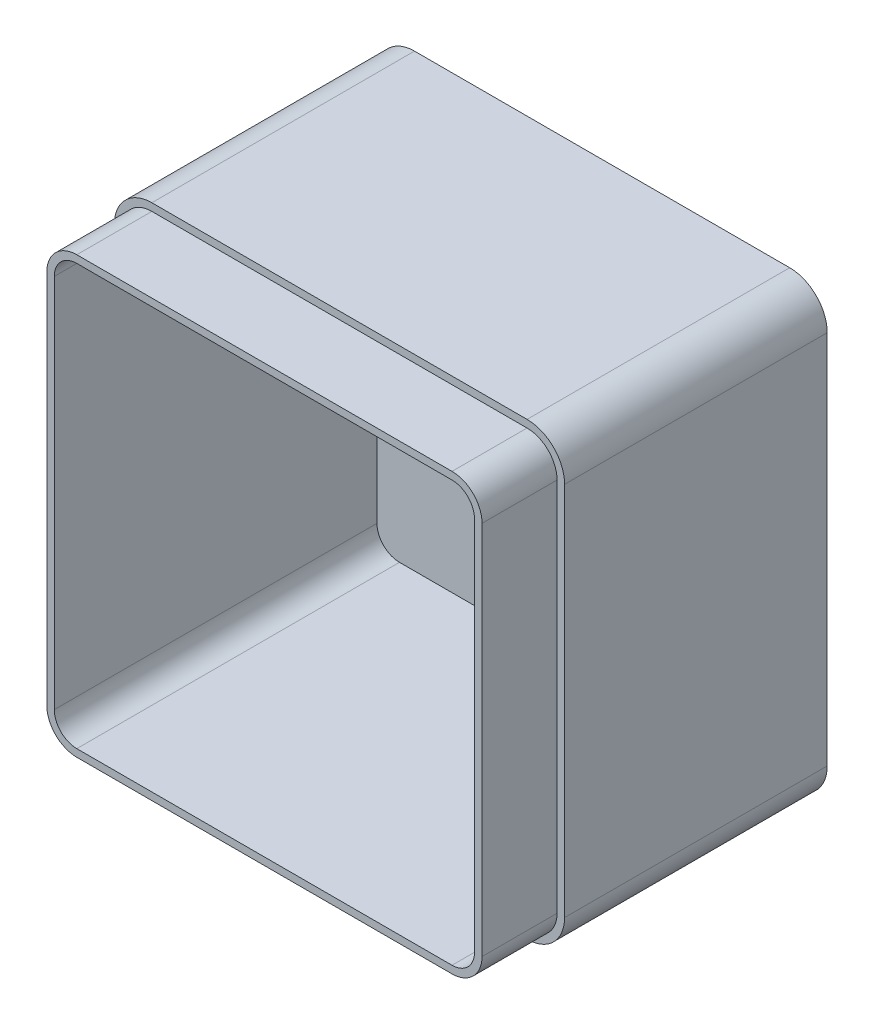
ISO-10303-21;
HEADER;
FILE_DESCRIPTION(('STEP AP214'),'2;1');
FILE_NAME('part.step','',(''),(''),'','','');
FILE_SCHEMA(('AUTOMOTIVE_DESIGN { 1 0 10303 214 1 1 1 1 }'));
ENDSEC;
DATA;
#1=APPLICATION_CONTEXT('core data for automotive mechanical design processes');
#2=APPLICATION_PROTOCOL_DEFINITION('international standard','automotive_design',2000,#1);
#3=PRODUCT_CONTEXT('',#1,'mechanical');
#4=PRODUCT('Part','Part','',(#3));
#5=PRODUCT_RELATED_PRODUCT_CATEGORY('part','',(#4));
#6=PRODUCT_DEFINITION_FORMATION('','',#4);
#7=PRODUCT_DEFINITION_CONTEXT('part definition',#1,'design');
#8=PRODUCT_DEFINITION('design','',#6,#7);
#9=PRODUCT_DEFINITION_SHAPE('','',#8);
#10=(LENGTH_UNIT() NAMED_UNIT(*) SI_UNIT(.MILLI.,.METRE.));
#11=(NAMED_UNIT(*) PLANE_ANGLE_UNIT() SI_UNIT($,.RADIAN.));
#12=(NAMED_UNIT(*) SI_UNIT($,.STERADIAN.) SOLID_ANGLE_UNIT());
#13=UNCERTAINTY_MEASURE_WITH_UNIT(LENGTH_MEASURE(1.E-05),#10,'distance_accuracy_value','');
#14=(GEOMETRIC_REPRESENTATION_CONTEXT(3) GLOBAL_UNCERTAINTY_ASSIGNED_CONTEXT((#13)) GLOBAL_UNIT_ASSIGNED_CONTEXT((#10,
#11,#12)) REPRESENTATION_CONTEXT('',''));
#15=CARTESIAN_POINT('',(0.,0.,0.));
#16=DIRECTION('',(0.,0.,1.));
#17=DIRECTION('',(1.,0.,0.));
#18=AXIS2_PLACEMENT_3D('',#15,#16,#17);
#19=CARTESIAN_POINT('',(0.,0.,90.));
#20=DIRECTION('',(0.,0.,-1.));
#21=DIRECTION('',(-1.,0.,0.));
#22=AXIS2_PLACEMENT_3D('',#19,#20,#21);
#23=PLANE('',#22);
#24=DIRECTION('',(0.,-1.,0.));
#25=VECTOR('',#24,1.);
#26=CARTESIAN_POINT('',(4.,0.,90.));
#27=LINE('',#26,#25);
#28=CARTESIAN_POINT('',(3.99999999999996,110.,90.));
#29=VERTEX_POINT('',#28);
#30=CARTESIAN_POINT('',(4.,10.,90.));
#31=VERTEX_POINT('',#30);
#32=EDGE_CURVE('E361',#29,#31,#27,.T.);
#33=ORIENTED_EDGE('',*,*,#32,.F.);
#34=CARTESIAN_POINT('',(9.99999999999996,110.,90.));
#35=DIRECTION('',(0.,0.,-1.));
#36=DIRECTION('',(-1.,0.,0.));
#37=AXIS2_PLACEMENT_3D('',#34,#35,#36);
#38=CIRCLE('',#37,6.);
#39=CARTESIAN_POINT('',(9.99999999999996,116.,90.));
#40=VERTEX_POINT('',#39);
#41=EDGE_CURVE('E407',#40,#29,#38,.F.);
#42=ORIENTED_EDGE('',*,*,#41,.F.);
#43=DIRECTION('',(-1.,0.,0.));
#44=VECTOR('',#43,1.);
#45=CARTESIAN_POINT('',(0.,116.,90.));
#46=LINE('',#45,#44);
#47=CARTESIAN_POINT('',(110.,116.,90.));
#48=VERTEX_POINT('',#47);
#49=EDGE_CURVE('E376',#48,#40,#46,.T.);
#50=ORIENTED_EDGE('',*,*,#49,.F.);
#51=CARTESIAN_POINT('',(110.,110.,90.));
#52=DIRECTION('',(0.,0.,-1.));
#53=DIRECTION('',(-1.,0.,0.));
#54=AXIS2_PLACEMENT_3D('',#51,#52,#53);
#55=CIRCLE('',#54,6.);
#56=CARTESIAN_POINT('',(116.,110.,90.));
#57=VERTEX_POINT('',#56);
#58=EDGE_CURVE('E340',#57,#48,#55,.F.);
#59=ORIENTED_EDGE('',*,*,#58,.F.);
#60=DIRECTION('',(0.,1.,0.));
#61=VECTOR('',#60,1.);
#62=CARTESIAN_POINT('',(116.,0.,90.));
#63=LINE('',#62,#61);
#64=CARTESIAN_POINT('',(116.,10.,90.));
#65=VERTEX_POINT('',#64);
#66=EDGE_CURVE('E404',#65,#57,#63,.T.);
#67=ORIENTED_EDGE('',*,*,#66,.F.);
#68=CARTESIAN_POINT('',(110.,10.,90.));
#69=DIRECTION('',(0.,0.,-1.));
#70=DIRECTION('',(-1.,0.,0.));
#71=AXIS2_PLACEMENT_3D('',#68,#69,#70);
#72=CIRCLE('',#71,6.);
#73=CARTESIAN_POINT('',(110.,4.,90.));
#74=VERTEX_POINT('',#73);
#75=EDGE_CURVE('E400',#74,#65,#72,.F.);
#76=ORIENTED_EDGE('',*,*,#75,.F.);
#77=DIRECTION('',(1.,0.,0.));
#78=VECTOR('',#77,1.);
#79=CARTESIAN_POINT('',(0.,4.,90.));
#80=LINE('',#79,#78);
#81=CARTESIAN_POINT('',(9.99999999999999,4.,90.));
#82=VERTEX_POINT('',#81);
#83=EDGE_CURVE('E397',#82,#74,#80,.T.);
#84=ORIENTED_EDGE('',*,*,#83,.F.);
#85=CARTESIAN_POINT('',(9.99999999999999,10.,90.));
#86=DIRECTION('',(0.,0.,-1.));
#87=DIRECTION('',(-1.,0.,0.));
#88=AXIS2_PLACEMENT_3D('',#85,#86,#87);
#89=CIRCLE('',#88,6.);
#90=EDGE_CURVE('E385',#31,#82,#89,.F.);
#91=ORIENTED_EDGE('',*,*,#90,.F.);
#92=EDGE_LOOP('',(#33,#42,#50,#59,#67,#76,#84,#91));
#93=FACE_BOUND('',#92,.T.);
#94=CARTESIAN_POINT('',(9.99999999999996,110.,90.));
#95=DIRECTION('',(0.,0.,1.));
#96=DIRECTION('',(1.,0.,0.));
#97=AXIS2_PLACEMENT_3D('',#94,#95,#96);
#98=CIRCLE('',#97,8.);
#99=CARTESIAN_POINT('',(9.99999999999995,118.,90.));
#100=VERTEX_POINT('',#99);
#101=CARTESIAN_POINT('',(1.99999999999996,110.,90.));
#102=VERTEX_POINT('',#101);
#103=EDGE_CURVE('E268',#100,#102,#98,.T.);
#104=ORIENTED_EDGE('',*,*,#103,.T.);
#105=DIRECTION('',(0.,-1.,0.));
#106=VECTOR('',#105,1.);
#107=CARTESIAN_POINT('',(1.99999999999996,110.,90.));
#108=LINE('',#107,#106);
#109=CARTESIAN_POINT('',(1.99999999999996,9.99999999999999,90.));
#110=VERTEX_POINT('',#109);
#111=EDGE_CURVE('E218',#102,#110,#108,.T.);
#112=ORIENTED_EDGE('',*,*,#111,.T.);
#113=CARTESIAN_POINT('',(9.99999999999999,10.,90.));
#114=DIRECTION('',(0.,0.,1.));
#115=DIRECTION('',(1.,0.,0.));
#116=AXIS2_PLACEMENT_3D('',#113,#114,#115);
#117=CIRCLE('',#116,8.00000000000001);
#118=CARTESIAN_POINT('',(9.99999999999999,1.99999999999998,90.));
#119=VERTEX_POINT('',#118);
#120=EDGE_CURVE('E66',#110,#119,#117,.T.);
#121=ORIENTED_EDGE('',*,*,#120,.T.);
#122=DIRECTION('',(1.,0.,0.));
#123=VECTOR('',#122,1.);
#124=CARTESIAN_POINT('',(9.99999999999999,2.,90.));
#125=LINE('',#124,#123);
#126=CARTESIAN_POINT('',(110.,2.,90.));
#127=VERTEX_POINT('',#126);
#128=EDGE_CURVE('E275',#119,#127,#125,.T.);
#129=ORIENTED_EDGE('',*,*,#128,.T.);
#130=CARTESIAN_POINT('',(110.,10.,90.));
#131=DIRECTION('',(0.,0.,1.));
#132=DIRECTION('',(1.,0.,0.));
#133=AXIS2_PLACEMENT_3D('',#130,#131,#132);
#134=CIRCLE('',#133,7.99999999999999);
#135=CARTESIAN_POINT('',(118.,10.,90.));
#136=VERTEX_POINT('',#135);
#137=EDGE_CURVE('E279',#127,#136,#134,.T.);
#138=ORIENTED_EDGE('',*,*,#137,.T.);
#139=DIRECTION('',(0.,1.,0.));
#140=VECTOR('',#139,1.);
#141=CARTESIAN_POINT('',(118.,9.99999999999999,90.));
#142=LINE('',#141,#140);
#143=CARTESIAN_POINT('',(118.,110.,90.));
#144=VERTEX_POINT('',#143);
#145=EDGE_CURVE('E283',#136,#144,#142,.T.);
#146=ORIENTED_EDGE('',*,*,#145,.T.);
#147=CARTESIAN_POINT('',(110.,110.,90.));
#148=DIRECTION('',(0.,0.,1.));
#149=DIRECTION('',(1.,0.,0.));
#150=AXIS2_PLACEMENT_3D('',#147,#148,#149);
#151=CIRCLE('',#150,8.00000000000001);
#152=CARTESIAN_POINT('',(110.,118.,90.));
#153=VERTEX_POINT('',#152);
#154=EDGE_CURVE('E245',#144,#153,#151,.T.);
#155=ORIENTED_EDGE('',*,*,#154,.T.);
#156=DIRECTION('',(-1.,0.,0.));
#157=VECTOR('',#156,1.);
#158=CARTESIAN_POINT('',(110.,118.,90.));
#159=LINE('',#158,#157);
#160=EDGE_CURVE('E241',#153,#100,#159,.T.);
#161=ORIENTED_EDGE('',*,*,#160,.T.);
#162=EDGE_LOOP('',(#104,#112,#121,#129,#138,#146,#155,#161));
#163=FACE_BOUND('',#162,.T.);
#164=ADVANCED_FACE('F50',(#93,#163),#23,.F.);
#165=CARTESIAN_POINT('',(4.,0.,90.));
#166=DIRECTION('',(1.,0.,0.));
#167=DIRECTION('',(0.,1.,0.));
#168=AXIS2_PLACEMENT_3D('',#165,#166,#167);
#169=PLANE('',#168);
#170=DIRECTION('',(0.,-1.,0.));
#171=VECTOR('',#170,1.);
#172=CARTESIAN_POINT('',(4.,0.,4.));
#173=LINE('',#172,#171);
#174=CARTESIAN_POINT('',(3.99999999999996,110.,4.));
#175=VERTEX_POINT('',#174);
#176=CARTESIAN_POINT('',(4.,10.,4.));
#177=VERTEX_POINT('',#176);
#178=EDGE_CURVE('E332',#175,#177,#173,.T.);
#179=ORIENTED_EDGE('',*,*,#178,.F.);
#180=DIRECTION('',(0.,0.,1.));
#181=VECTOR('',#180,1.);
#182=CARTESIAN_POINT('',(3.99999999999996,110.,90.));
#183=LINE('',#182,#181);
#184=EDGE_CURVE('E341',#29,#175,#183,.F.);
#185=ORIENTED_EDGE('',*,*,#184,.F.);
#186=ORIENTED_EDGE('',*,*,#32,.T.);
#187=DIRECTION('',(0.,0.,1.));
#188=VECTOR('',#187,1.);
#189=CARTESIAN_POINT('',(4.,10.,90.));
#190=LINE('',#189,#188);
#191=EDGE_CURVE('E337',#177,#31,#190,.T.);
#192=ORIENTED_EDGE('',*,*,#191,.F.);
#193=EDGE_LOOP('',(#179,#185,#186,#192));
#194=FACE_BOUND('',#193,.T.);
#195=ADVANCED_FACE('F515',(#194),#169,.T.);
#196=CARTESIAN_POINT('',(0.,4.,90.));
#197=DIRECTION('',(0.,1.,0.));
#198=DIRECTION('',(0.,0.,1.));
#199=AXIS2_PLACEMENT_3D('',#196,#197,#198);
#200=PLANE('',#199);
#201=ORIENTED_EDGE('',*,*,#83,.T.);
#202=DIRECTION('',(0.,0.,1.));
#203=VECTOR('',#202,1.);
#204=CARTESIAN_POINT('',(110.,4.,90.));
#205=LINE('',#204,#203);
#206=CARTESIAN_POINT('',(110.,4.,4.));
#207=VERTEX_POINT('',#206);
#208=EDGE_CURVE('E373',#207,#74,#205,.T.);
#209=ORIENTED_EDGE('',*,*,#208,.F.);
#210=DIRECTION('',(1.,0.,0.));
#211=VECTOR('',#210,1.);
#212=CARTESIAN_POINT('',(0.,4.,4.));
#213=LINE('',#212,#211);
#214=CARTESIAN_POINT('',(9.99999999999999,4.,4.));
#215=VERTEX_POINT('',#214);
#216=EDGE_CURVE('E336',#215,#207,#213,.T.);
#217=ORIENTED_EDGE('',*,*,#216,.F.);
#218=DIRECTION('',(0.,0.,1.));
#219=VECTOR('',#218,1.);
#220=CARTESIAN_POINT('',(9.99999999999999,4.,90.));
#221=LINE('',#220,#219);
#222=EDGE_CURVE('E364',#82,#215,#221,.F.);
#223=ORIENTED_EDGE('',*,*,#222,.F.);
#224=EDGE_LOOP('',(#201,#209,#217,#223));
#225=FACE_BOUND('',#224,.T.);
#226=ADVANCED_FACE('F521',(#225),#200,.T.);
#227=CARTESIAN_POINT('',(116.,0.,90.));
#228=DIRECTION('',(-1.,0.,0.));
#229=DIRECTION('',(0.,-1.,0.));
#230=AXIS2_PLACEMENT_3D('',#227,#228,#229);
#231=PLANE('',#230);
#232=ORIENTED_EDGE('',*,*,#66,.T.);
#233=DIRECTION('',(0.,0.,1.));
#234=VECTOR('',#233,1.);
#235=CARTESIAN_POINT('',(116.,110.,90.));
#236=LINE('',#235,#234);
#237=CARTESIAN_POINT('',(116.,110.,4.));
#238=VERTEX_POINT('',#237);
#239=EDGE_CURVE('E382',#238,#57,#236,.T.);
#240=ORIENTED_EDGE('',*,*,#239,.F.);
#241=DIRECTION('',(0.,1.,0.));
#242=VECTOR('',#241,1.);
#243=CARTESIAN_POINT('',(116.,0.,4.));
#244=LINE('',#243,#242);
#245=CARTESIAN_POINT('',(116.,10.,4.));
#246=VERTEX_POINT('',#245);
#247=EDGE_CURVE('E349',#246,#238,#244,.T.);
#248=ORIENTED_EDGE('',*,*,#247,.F.);
#249=DIRECTION('',(0.,0.,1.));
#250=VECTOR('',#249,1.);
#251=CARTESIAN_POINT('',(116.,10.,90.));
#252=LINE('',#251,#250);
#253=EDGE_CURVE('E377',#65,#246,#252,.F.);
#254=ORIENTED_EDGE('',*,*,#253,.F.);
#255=EDGE_LOOP('',(#232,#240,#248,#254));
#256=FACE_BOUND('',#255,.T.);
#257=ADVANCED_FACE('F737',(#256),#231,.T.);
#258=CARTESIAN_POINT('',(0.,116.,90.));
#259=DIRECTION('',(0.,-1.,0.));
#260=DIRECTION('',(0.,0.,-1.));
#261=AXIS2_PLACEMENT_3D('',#258,#259,#260);
#262=PLANE('',#261);
#263=DIRECTION('',(-1.,0.,0.));
#264=VECTOR('',#263,1.);
#265=CARTESIAN_POINT('',(0.,116.,4.));
#266=LINE('',#265,#264);
#267=CARTESIAN_POINT('',(110.,116.,4.));
#268=VERTEX_POINT('',#267);
#269=CARTESIAN_POINT('',(9.99999999999996,116.,4.));
#270=VERTEX_POINT('',#269);
#271=EDGE_CURVE('E357',#268,#270,#266,.T.);
#272=ORIENTED_EDGE('',*,*,#271,.F.);
#273=DIRECTION('',(0.,0.,-1.));
#274=VECTOR('',#273,1.);
#275=CARTESIAN_POINT('',(110.,116.,90.));
#276=LINE('',#275,#274);
#277=EDGE_CURVE('E381',#48,#268,#276,.T.);
#278=ORIENTED_EDGE('',*,*,#277,.F.);
#279=ORIENTED_EDGE('',*,*,#49,.T.);
#280=DIRECTION('',(0.,0.,-1.));
#281=VECTOR('',#280,1.);
#282=CARTESIAN_POINT('',(9.99999999999996,116.,90.));
#283=LINE('',#282,#281);
#284=EDGE_CURVE('E389',#270,#40,#283,.F.);
#285=ORIENTED_EDGE('',*,*,#284,.F.);
#286=EDGE_LOOP('',(#272,#278,#279,#285));
#287=FACE_BOUND('',#286,.T.);
#288=ADVANCED_FACE('F729',(#287),#262,.T.);
#289=CARTESIAN_POINT('',(0.,0.,4.));
#290=DIRECTION('',(0.,0.,-1.));
#291=DIRECTION('',(-1.,0.,0.));
#292=AXIS2_PLACEMENT_3D('',#289,#290,#291);
#293=PLANE('',#292);
#294=ORIENTED_EDGE('',*,*,#216,.T.);
#295=CARTESIAN_POINT('',(110.,10.,4.));
#296=DIRECTION('',(0.,0.,-1.));
#297=DIRECTION('',(-1.,0.,0.));
#298=AXIS2_PLACEMENT_3D('',#295,#296,#297);
#299=CIRCLE('',#298,6.);
#300=EDGE_CURVE('E352',#246,#207,#299,.T.);
#301=ORIENTED_EDGE('',*,*,#300,.F.);
#302=ORIENTED_EDGE('',*,*,#247,.T.);
#303=CARTESIAN_POINT('',(110.,110.,4.));
#304=DIRECTION('',(0.,0.,-1.));
#305=DIRECTION('',(-1.,0.,0.));
#306=AXIS2_PLACEMENT_3D('',#303,#304,#305);
#307=CIRCLE('',#306,6.);
#308=EDGE_CURVE('E356',#268,#238,#307,.T.);
#309=ORIENTED_EDGE('',*,*,#308,.F.);
#310=ORIENTED_EDGE('',*,*,#271,.T.);
#311=CARTESIAN_POINT('',(9.99999999999996,110.,4.));
#312=DIRECTION('',(0.,0.,-1.));
#313=DIRECTION('',(-1.,0.,0.));
#314=AXIS2_PLACEMENT_3D('',#311,#312,#313);
#315=CIRCLE('',#314,6.);
#316=EDGE_CURVE('E353',#175,#270,#315,.T.);
#317=ORIENTED_EDGE('',*,*,#316,.F.);
#318=ORIENTED_EDGE('',*,*,#178,.T.);
#319=CARTESIAN_POINT('',(9.99999999999999,10.,4.));
#320=DIRECTION('',(0.,0.,-1.));
#321=DIRECTION('',(-1.,0.,0.));
#322=AXIS2_PLACEMENT_3D('',#319,#320,#321);
#323=CIRCLE('',#322,6.);
#324=EDGE_CURVE('E345',#215,#177,#323,.T.);
#325=ORIENTED_EDGE('',*,*,#324,.F.);
#326=EDGE_LOOP('',(#294,#301,#302,#309,#310,#317,#318,#325));
#327=FACE_BOUND('',#326,.T.);
#328=ADVANCED_FACE('F721',(#327),#293,.F.);
#329=CARTESIAN_POINT('',(9.99999999999999,10.,90.));
#330=DIRECTION('',(0.,0.,-1.));
#331=DIRECTION('',(-1.,0.,0.));
#332=AXIS2_PLACEMENT_3D('',#329,#330,#331);
#333=CYLINDRICAL_SURFACE('',#332,6.);
#334=ORIENTED_EDGE('',*,*,#90,.T.);
#335=ORIENTED_EDGE('',*,*,#222,.T.);
#336=ORIENTED_EDGE('',*,*,#324,.T.);
#337=ORIENTED_EDGE('',*,*,#191,.T.);
#338=EDGE_LOOP('',(#334,#335,#336,#337));
#339=FACE_BOUND('',#338,.T.);
#340=ADVANCED_FACE('F713',(#339),#333,.F.);
#341=CARTESIAN_POINT('',(110.,10.,90.));
#342=DIRECTION('',(0.,0.,-1.));
#343=DIRECTION('',(-1.,0.,0.));
#344=AXIS2_PLACEMENT_3D('',#341,#342,#343);
#345=CYLINDRICAL_SURFACE('',#344,6.);
#346=ORIENTED_EDGE('',*,*,#75,.T.);
#347=ORIENTED_EDGE('',*,*,#253,.T.);
#348=ORIENTED_EDGE('',*,*,#300,.T.);
#349=ORIENTED_EDGE('',*,*,#208,.T.);
#350=EDGE_LOOP('',(#346,#347,#348,#349));
#351=FACE_BOUND('',#350,.T.);
#352=ADVANCED_FACE('F706',(#351),#345,.F.);
#353=CARTESIAN_POINT('',(9.99999999999996,110.,90.));
#354=DIRECTION('',(0.,0.,-1.));
#355=DIRECTION('',(-1.,0.,0.));
#356=AXIS2_PLACEMENT_3D('',#353,#354,#355);
#357=CYLINDRICAL_SURFACE('',#356,6.);
#358=ORIENTED_EDGE('',*,*,#41,.T.);
#359=ORIENTED_EDGE('',*,*,#184,.T.);
#360=ORIENTED_EDGE('',*,*,#316,.T.);
#361=ORIENTED_EDGE('',*,*,#284,.T.);
#362=EDGE_LOOP('',(#358,#359,#360,#361));
#363=FACE_BOUND('',#362,.T.);
#364=ADVANCED_FACE('F702',(#363),#357,.F.);
#365=CARTESIAN_POINT('',(110.,110.,90.));
#366=DIRECTION('',(0.,0.,-1.));
#367=DIRECTION('',(-1.,0.,0.));
#368=AXIS2_PLACEMENT_3D('',#365,#366,#367);
#369=CYLINDRICAL_SURFACE('',#368,6.);
#370=ORIENTED_EDGE('',*,*,#58,.T.);
#371=ORIENTED_EDGE('',*,*,#277,.T.);
#372=ORIENTED_EDGE('',*,*,#308,.T.);
#373=ORIENTED_EDGE('',*,*,#239,.T.);
#374=EDGE_LOOP('',(#370,#371,#372,#373));
#375=FACE_BOUND('',#374,.T.);
#376=ADVANCED_FACE('F528',(#375),#369,.F.);
#377=CARTESIAN_POINT('',(9.99999999999996,110.,70.));
#378=DIRECTION('',(0.,0.,1.));
#379=DIRECTION('',(1.,0.,0.));
#380=AXIS2_PLACEMENT_3D('',#377,#378,#379);
#381=PLANE('',#380);
#382=DIRECTION('',(-1.,0.,0.));
#383=VECTOR('',#382,1.);
#384=CARTESIAN_POINT('',(110.,118.,70.));
#385=LINE('',#384,#383);
#386=CARTESIAN_POINT('',(110.,118.,70.));
#387=VERTEX_POINT('',#386);
#388=CARTESIAN_POINT('',(9.99999999999995,118.,70.));
#389=VERTEX_POINT('',#388);
#390=EDGE_CURVE('E225',#387,#389,#385,.T.);
#391=ORIENTED_EDGE('',*,*,#390,.F.);
#392=CARTESIAN_POINT('',(110.,110.,70.));
#393=DIRECTION('',(0.,0.,1.));
#394=DIRECTION('',(1.,0.,0.));
#395=AXIS2_PLACEMENT_3D('',#392,#393,#394);
#396=CIRCLE('',#395,8.00000000000001);
#397=CARTESIAN_POINT('',(118.,110.,70.));
#398=VERTEX_POINT('',#397);
#399=EDGE_CURVE('E262',#398,#387,#396,.T.);
#400=ORIENTED_EDGE('',*,*,#399,.F.);
#401=DIRECTION('',(0.,1.,0.));
#402=VECTOR('',#401,1.);
#403=CARTESIAN_POINT('',(118.,9.99999999999999,70.));
#404=LINE('',#403,#402);
#405=CARTESIAN_POINT('',(118.,10.,70.));
#406=VERTEX_POINT('',#405);
#407=EDGE_CURVE('E258',#406,#398,#404,.T.);
#408=ORIENTED_EDGE('',*,*,#407,.F.);
#409=CARTESIAN_POINT('',(110.,10.,70.));
#410=DIRECTION('',(0.,0.,1.));
#411=DIRECTION('',(1.,0.,0.));
#412=AXIS2_PLACEMENT_3D('',#409,#410,#411);
#413=CIRCLE('',#412,7.99999999999999);
#414=CARTESIAN_POINT('',(110.,2.,70.));
#415=VERTEX_POINT('',#414);
#416=EDGE_CURVE('E254',#415,#406,#413,.T.);
#417=ORIENTED_EDGE('',*,*,#416,.F.);
#418=DIRECTION('',(1.,0.,0.));
#419=VECTOR('',#418,1.);
#420=CARTESIAN_POINT('',(9.99999999999999,2.,70.));
#421=LINE('',#420,#419);
#422=CARTESIAN_POINT('',(9.99999999999999,1.99999999999998,70.));
#423=VERTEX_POINT('',#422);
#424=EDGE_CURVE('E250',#423,#415,#421,.T.);
#425=ORIENTED_EDGE('',*,*,#424,.F.);
#426=CARTESIAN_POINT('',(9.99999999999999,10.,70.));
#427=DIRECTION('',(0.,0.,1.));
#428=DIRECTION('',(1.,0.,0.));
#429=AXIS2_PLACEMENT_3D('',#426,#427,#428);
#430=CIRCLE('',#429,8.00000000000001);
#431=CARTESIAN_POINT('',(1.99999999999996,9.99999999999999,70.));
#432=VERTEX_POINT('',#431);
#433=EDGE_CURVE('E235',#432,#423,#430,.T.);
#434=ORIENTED_EDGE('',*,*,#433,.F.);
#435=DIRECTION('',(0.,-1.,0.));
#436=VECTOR('',#435,1.);
#437=CARTESIAN_POINT('',(1.99999999999996,110.,70.));
#438=LINE('',#437,#436);
#439=CARTESIAN_POINT('',(1.99999999999996,110.,70.));
#440=VERTEX_POINT('',#439);
#441=EDGE_CURVE('E216',#440,#432,#438,.T.);
#442=ORIENTED_EDGE('',*,*,#441,.F.);
#443=CARTESIAN_POINT('',(9.99999999999996,110.,70.));
#444=DIRECTION('',(0.,0.,1.));
#445=DIRECTION('',(1.,0.,0.));
#446=AXIS2_PLACEMENT_3D('',#443,#444,#445);
#447=CIRCLE('',#446,8.);
#448=EDGE_CURVE('E231',#389,#440,#447,.T.);
#449=ORIENTED_EDGE('',*,*,#448,.F.);
#450=EDGE_LOOP('',(#391,#400,#408,#417,#425,#434,#442,#449));
#451=FACE_BOUND('',#450,.T.);
#452=CARTESIAN_POINT('',(9.99999999999996,110.,70.));
#453=DIRECTION('',(0.,0.,1.));
#454=DIRECTION('',(1.,0.,0.));
#455=AXIS2_PLACEMENT_3D('',#452,#453,#454);
#456=CIRCLE('',#455,10.);
#457=CARTESIAN_POINT('',(9.99999999999996,120.,70.));
#458=VERTEX_POINT('',#457);
#459=CARTESIAN_POINT('',(0.,110.,70.));
#460=VERTEX_POINT('',#459);
#461=EDGE_CURVE('E292',#458,#460,#456,.T.);
#462=ORIENTED_EDGE('',*,*,#461,.T.);
#463=DIRECTION('',(0.,-1.,0.));
#464=VECTOR('',#463,1.);
#465=CARTESIAN_POINT('',(0.,110.,70.));
#466=LINE('',#465,#464);
#467=CARTESIAN_POINT('',(0.,9.99999999999999,70.));
#468=VERTEX_POINT('',#467);
#469=EDGE_CURVE('E312',#460,#468,#466,.T.);
#470=ORIENTED_EDGE('',*,*,#469,.T.);
#471=CARTESIAN_POINT('',(9.99999999999999,10.,70.));
#472=DIRECTION('',(0.,0.,1.));
#473=DIRECTION('',(1.,0.,0.));
#474=AXIS2_PLACEMENT_3D('',#471,#472,#473);
#475=CIRCLE('',#474,10.);
#476=CARTESIAN_POINT('',(9.99999999999999,0.,70.));
#477=VERTEX_POINT('',#476);
#478=EDGE_CURVE('E315',#468,#477,#475,.T.);
#479=ORIENTED_EDGE('',*,*,#478,.T.);
#480=DIRECTION('',(1.,0.,0.));
#481=VECTOR('',#480,1.);
#482=CARTESIAN_POINT('',(9.99999999999999,0.,70.));
#483=LINE('',#482,#481);
#484=CARTESIAN_POINT('',(110.,0.,70.));
#485=VERTEX_POINT('',#484);
#486=EDGE_CURVE('E318',#477,#485,#483,.T.);
#487=ORIENTED_EDGE('',*,*,#486,.T.);
#488=CARTESIAN_POINT('',(110.,10.,70.));
#489=DIRECTION('',(0.,0.,1.));
#490=DIRECTION('',(1.,0.,0.));
#491=AXIS2_PLACEMENT_3D('',#488,#489,#490);
#492=CIRCLE('',#491,9.99999999999999);
#493=CARTESIAN_POINT('',(120.,10.,70.));
#494=VERTEX_POINT('',#493);
#495=EDGE_CURVE('E321',#485,#494,#492,.T.);
#496=ORIENTED_EDGE('',*,*,#495,.T.);
#497=DIRECTION('',(0.,1.,0.));
#498=VECTOR('',#497,1.);
#499=CARTESIAN_POINT('',(120.,10.,70.));
#500=LINE('',#499,#498);
#501=CARTESIAN_POINT('',(120.,110.,70.));
#502=VERTEX_POINT('',#501);
#503=EDGE_CURVE('E74',#494,#502,#500,.T.);
#504=ORIENTED_EDGE('',*,*,#503,.T.);
#505=CARTESIAN_POINT('',(110.,110.,70.));
#506=DIRECTION('',(0.,0.,1.));
#507=DIRECTION('',(1.,0.,0.));
#508=AXIS2_PLACEMENT_3D('',#505,#506,#507);
#509=CIRCLE('',#508,9.99999999999999);
#510=CARTESIAN_POINT('',(110.,120.,70.));
#511=VERTEX_POINT('',#510);
#512=EDGE_CURVE('E326',#502,#511,#509,.T.);
#513=ORIENTED_EDGE('',*,*,#512,.T.);
#514=DIRECTION('',(-1.,0.,0.));
#515=VECTOR('',#514,1.);
#516=CARTESIAN_POINT('',(110.,120.,70.));
#517=LINE('',#516,#515);
#518=EDGE_CURVE('E329',#511,#458,#517,.T.);
#519=ORIENTED_EDGE('',*,*,#518,.T.);
#520=EDGE_LOOP('',(#462,#470,#479,#487,#496,#504,#513,#519));
#521=FACE_BOUND('',#520,.T.);
#522=ADVANCED_FACE('F230',(#451,#521),#381,.T.);
#523=CARTESIAN_POINT('',(9.99999999999996,110.,70.));
#524=DIRECTION('',(0.,0.,1.));
#525=DIRECTION('',(1.,0.,0.));
#526=AXIS2_PLACEMENT_3D('',#523,#524,#525);
#527=CYLINDRICAL_SURFACE('',#526,8.);
#528=ORIENTED_EDGE('',*,*,#103,.F.);
#529=DIRECTION('',(0.,0.,1.));
#530=VECTOR('',#529,1.);
#531=CARTESIAN_POINT('',(9.99999999999995,118.,70.));
#532=LINE('',#531,#530);
#533=EDGE_CURVE('E239',#389,#100,#532,.T.);
#534=ORIENTED_EDGE('',*,*,#533,.F.);
#535=ORIENTED_EDGE('',*,*,#448,.T.);
#536=DIRECTION('',(0.,0.,1.));
#537=VECTOR('',#536,1.);
#538=CARTESIAN_POINT('',(1.99999999999996,110.,70.));
#539=LINE('',#538,#537);
#540=EDGE_CURVE('E213',#440,#102,#539,.T.);
#541=ORIENTED_EDGE('',*,*,#540,.T.);
#542=EDGE_LOOP('',(#528,#534,#535,#541));
#543=FACE_BOUND('',#542,.T.);
#544=ADVANCED_FACE('F238',(#543),#527,.T.);
#545=CARTESIAN_POINT('',(110.,118.,70.));
#546=DIRECTION('',(0.,1.,0.));
#547=DIRECTION('',(0.,0.,1.));
#548=AXIS2_PLACEMENT_3D('',#545,#546,#547);
#549=PLANE('',#548);
#550=ORIENTED_EDGE('',*,*,#160,.F.);
#551=DIRECTION('',(0.,0.,1.));
#552=VECTOR('',#551,1.);
#553=CARTESIAN_POINT('',(110.,118.,70.));
#554=LINE('',#553,#552);
#555=EDGE_CURVE('E293',#387,#153,#554,.T.);
#556=ORIENTED_EDGE('',*,*,#555,.F.);
#557=ORIENTED_EDGE('',*,*,#390,.T.);
#558=ORIENTED_EDGE('',*,*,#533,.T.);
#559=EDGE_LOOP('',(#550,#556,#557,#558));
#560=FACE_BOUND('',#559,.T.);
#561=ADVANCED_FACE('F573',(#560),#549,.T.);
#562=CARTESIAN_POINT('',(110.,110.,70.));
#563=DIRECTION('',(0.,0.,1.));
#564=DIRECTION('',(1.,0.,0.));
#565=AXIS2_PLACEMENT_3D('',#562,#563,#564);
#566=CYLINDRICAL_SURFACE('',#565,8.00000000000001);
#567=ORIENTED_EDGE('',*,*,#154,.F.);
#568=DIRECTION('',(0.,0.,1.));
#569=VECTOR('',#568,1.);
#570=CARTESIAN_POINT('',(118.,110.,70.));
#571=LINE('',#570,#569);
#572=EDGE_CURVE('E296',#398,#144,#571,.T.);
#573=ORIENTED_EDGE('',*,*,#572,.F.);
#574=ORIENTED_EDGE('',*,*,#399,.T.);
#575=ORIENTED_EDGE('',*,*,#555,.T.);
#576=EDGE_LOOP('',(#567,#573,#574,#575));
#577=FACE_BOUND('',#576,.T.);
#578=ADVANCED_FACE('F582',(#577),#566,.T.);
#579=CARTESIAN_POINT('',(118.,9.99999999999999,70.));
#580=DIRECTION('',(1.,0.,0.));
#581=DIRECTION('',(0.,0.,-1.));
#582=AXIS2_PLACEMENT_3D('',#579,#580,#581);
#583=PLANE('',#582);
#584=ORIENTED_EDGE('',*,*,#145,.F.);
#585=DIRECTION('',(0.,0.,1.));
#586=VECTOR('',#585,1.);
#587=CARTESIAN_POINT('',(118.,10.,70.));
#588=LINE('',#587,#586);
#589=EDGE_CURVE('E299',#406,#136,#588,.T.);
#590=ORIENTED_EDGE('',*,*,#589,.F.);
#591=ORIENTED_EDGE('',*,*,#407,.T.);
#592=ORIENTED_EDGE('',*,*,#572,.T.);
#593=EDGE_LOOP('',(#584,#590,#591,#592));
#594=FACE_BOUND('',#593,.T.);
#595=ADVANCED_FACE('F592',(#594),#583,.T.);
#596=CARTESIAN_POINT('',(110.,10.,70.));
#597=DIRECTION('',(0.,0.,1.));
#598=DIRECTION('',(1.,0.,0.));
#599=AXIS2_PLACEMENT_3D('',#596,#597,#598);
#600=CYLINDRICAL_SURFACE('',#599,7.99999999999999);
#601=ORIENTED_EDGE('',*,*,#137,.F.);
#602=DIRECTION('',(0.,0.,1.));
#603=VECTOR('',#602,1.);
#604=CARTESIAN_POINT('',(110.,2.,70.));
#605=LINE('',#604,#603);
#606=EDGE_CURVE('E302',#415,#127,#605,.T.);
#607=ORIENTED_EDGE('',*,*,#606,.F.);
#608=ORIENTED_EDGE('',*,*,#416,.T.);
#609=ORIENTED_EDGE('',*,*,#589,.T.);
#610=EDGE_LOOP('',(#601,#607,#608,#609));
#611=FACE_BOUND('',#610,.T.);
#612=ADVANCED_FACE('F602',(#611),#600,.T.);
#613=CARTESIAN_POINT('',(9.99999999999999,2.,70.));
#614=DIRECTION('',(0.,-1.,0.));
#615=DIRECTION('',(0.,0.,-1.));
#616=AXIS2_PLACEMENT_3D('',#613,#614,#615);
#617=PLANE('',#616);
#618=ORIENTED_EDGE('',*,*,#128,.F.);
#619=DIRECTION('',(0.,0.,1.));
#620=VECTOR('',#619,1.);
#621=CARTESIAN_POINT('',(9.99999999999999,1.99999999999998,70.));
#622=LINE('',#621,#620);
#623=EDGE_CURVE('E305',#423,#119,#622,.T.);
#624=ORIENTED_EDGE('',*,*,#623,.F.);
#625=ORIENTED_EDGE('',*,*,#424,.T.);
#626=ORIENTED_EDGE('',*,*,#606,.T.);
#627=EDGE_LOOP('',(#618,#624,#625,#626));
#628=FACE_BOUND('',#627,.T.);
#629=ADVANCED_FACE('F612',(#628),#617,.T.);
#630=CARTESIAN_POINT('',(9.99999999999999,10.,70.));
#631=DIRECTION('',(0.,0.,1.));
#632=DIRECTION('',(1.,0.,0.));
#633=AXIS2_PLACEMENT_3D('',#630,#631,#632);
#634=CYLINDRICAL_SURFACE('',#633,8.00000000000001);
#635=ORIENTED_EDGE('',*,*,#120,.F.);
#636=DIRECTION('',(0.,0.,1.));
#637=VECTOR('',#636,1.);
#638=CARTESIAN_POINT('',(1.99999999999996,9.99999999999999,70.));
#639=LINE('',#638,#637);
#640=EDGE_CURVE('E224',#432,#110,#639,.T.);
#641=ORIENTED_EDGE('',*,*,#640,.F.);
#642=ORIENTED_EDGE('',*,*,#433,.T.);
#643=ORIENTED_EDGE('',*,*,#623,.T.);
#644=EDGE_LOOP('',(#635,#641,#642,#643));
#645=FACE_BOUND('',#644,.T.);
#646=ADVANCED_FACE('F622',(#645),#634,.T.);
#647=CARTESIAN_POINT('',(1.99999999999996,110.,70.));
#648=DIRECTION('',(-1.,0.,0.));
#649=DIRECTION('',(0.,0.,1.));
#650=AXIS2_PLACEMENT_3D('',#647,#648,#649);
#651=PLANE('',#650);
#652=ORIENTED_EDGE('',*,*,#111,.F.);
#653=ORIENTED_EDGE('',*,*,#540,.F.);
#654=ORIENTED_EDGE('',*,*,#441,.T.);
#655=ORIENTED_EDGE('',*,*,#640,.T.);
#656=EDGE_LOOP('',(#652,#653,#654,#655));
#657=FACE_BOUND('',#656,.T.);
#658=ADVANCED_FACE('F215',(#657),#651,.T.);
#659=CARTESIAN_POINT('',(0.,0.,0.));
#660=DIRECTION('',(0.,0.,-1.));
#661=DIRECTION('',(-1.,0.,0.));
#662=AXIS2_PLACEMENT_3D('',#659,#660,#661);
#663=PLANE('',#662);
#664=DIRECTION('',(1.,0.,0.));
#665=VECTOR('',#664,1.);
#666=CARTESIAN_POINT('',(0.,0.,0.));
#667=LINE('',#666,#665);
#668=CARTESIAN_POINT('',(9.99999999999999,0.,0.));
#669=VERTEX_POINT('',#668);
#670=CARTESIAN_POINT('',(110.,0.,0.));
#671=VERTEX_POINT('',#670);
#672=EDGE_CURVE('E420',#669,#671,#667,.T.);
#673=ORIENTED_EDGE('',*,*,#672,.F.);
#674=CARTESIAN_POINT('',(9.99999999999999,10.,0.));
#675=DIRECTION('',(0.,0.,-1.));
#676=DIRECTION('',(-1.,0.,0.));
#677=AXIS2_PLACEMENT_3D('',#674,#675,#676);
#678=CIRCLE('',#677,10.);
#679=CARTESIAN_POINT('',(0.,9.99999999999999,0.));
#680=VERTEX_POINT('',#679);
#681=EDGE_CURVE('E448',#669,#680,#678,.T.);
#682=ORIENTED_EDGE('',*,*,#681,.T.);
#683=DIRECTION('',(0.,-1.,0.));
#684=VECTOR('',#683,1.);
#685=CARTESIAN_POINT('',(0.,0.,0.));
#686=LINE('',#685,#684);
#687=CARTESIAN_POINT('',(0.,110.,0.));
#688=VERTEX_POINT('',#687);
#689=EDGE_CURVE('E393',#688,#680,#686,.T.);
#690=ORIENTED_EDGE('',*,*,#689,.F.);
#691=CARTESIAN_POINT('',(9.99999999999996,110.,0.));
#692=DIRECTION('',(0.,0.,-1.));
#693=DIRECTION('',(-1.,0.,0.));
#694=AXIS2_PLACEMENT_3D('',#691,#692,#693);
#695=CIRCLE('',#694,10.);
#696=CARTESIAN_POINT('',(9.99999999999996,120.,0.));
#697=VERTEX_POINT('',#696);
#698=EDGE_CURVE('E442',#688,#697,#695,.T.);
#699=ORIENTED_EDGE('',*,*,#698,.T.);
#700=DIRECTION('',(-1.,0.,0.));
#701=VECTOR('',#700,1.);
#702=CARTESIAN_POINT('',(0.,120.,0.));
#703=LINE('',#702,#701);
#704=CARTESIAN_POINT('',(110.,120.,0.));
#705=VERTEX_POINT('',#704);
#706=EDGE_CURVE('E428',#705,#697,#703,.T.);
#707=ORIENTED_EDGE('',*,*,#706,.F.);
#708=CARTESIAN_POINT('',(110.,110.,0.));
#709=DIRECTION('',(0.,0.,-1.));
#710=DIRECTION('',(-1.,0.,0.));
#711=AXIS2_PLACEMENT_3D('',#708,#709,#710);
#712=CIRCLE('',#711,10.);
#713=CARTESIAN_POINT('',(120.,110.,0.));
#714=VERTEX_POINT('',#713);
#715=EDGE_CURVE('E439',#705,#714,#712,.T.);
#716=ORIENTED_EDGE('',*,*,#715,.T.);
#717=DIRECTION('',(0.,1.,0.));
#718=VECTOR('',#717,1.);
#719=CARTESIAN_POINT('',(120.,0.,0.));
#720=LINE('',#719,#718);
#721=CARTESIAN_POINT('',(120.,10.,0.));
#722=VERTEX_POINT('',#721);
#723=EDGE_CURVE('E424',#722,#714,#720,.T.);
#724=ORIENTED_EDGE('',*,*,#723,.F.);
#725=CARTESIAN_POINT('',(110.,10.,0.));
#726=DIRECTION('',(0.,0.,-1.));
#727=DIRECTION('',(-1.,0.,0.));
#728=AXIS2_PLACEMENT_3D('',#725,#726,#727);
#729=CIRCLE('',#728,10.);
#730=EDGE_CURVE('E445',#722,#671,#729,.T.);
#731=ORIENTED_EDGE('',*,*,#730,.T.);
#732=EDGE_LOOP('',(#673,#682,#690,#699,#707,#716,#724,#731));
#733=FACE_BOUND('',#732,.T.);
#734=ADVANCED_FACE('F477',(#733),#663,.T.);
#735=CARTESIAN_POINT('',(9.99999999999996,110.,90.));
#736=DIRECTION('',(0.,0.,-1.));
#737=DIRECTION('',(-1.,0.,0.));
#738=AXIS2_PLACEMENT_3D('',#735,#736,#737);
#739=CYLINDRICAL_SURFACE('',#738,10.);
#740=DIRECTION('',(0.,0.,-1.));
#741=VECTOR('',#740,1.);
#742=CARTESIAN_POINT('',(0.,110.,90.));
#743=LINE('',#742,#741);
#744=EDGE_CURVE('E451',#460,#688,#743,.T.);
#745=ORIENTED_EDGE('',*,*,#744,.F.);
#746=ORIENTED_EDGE('',*,*,#461,.F.);
#747=DIRECTION('',(0.,0.,-1.));
#748=VECTOR('',#747,1.);
#749=CARTESIAN_POINT('',(9.99999999999996,120.,90.));
#750=LINE('',#749,#748);
#751=EDGE_CURVE('E12',#697,#458,#750,.F.);
#752=ORIENTED_EDGE('',*,*,#751,.F.);
#753=ORIENTED_EDGE('',*,*,#698,.F.);
#754=EDGE_LOOP('',(#745,#746,#752,#753));
#755=FACE_BOUND('',#754,.T.);
#756=ADVANCED_FACE('F482',(#755),#739,.T.);
#757=CARTESIAN_POINT('',(110.,110.,90.));
#758=DIRECTION('',(0.,0.,-1.));
#759=DIRECTION('',(-1.,0.,0.));
#760=AXIS2_PLACEMENT_3D('',#757,#758,#759);
#761=CYLINDRICAL_SURFACE('',#760,10.);
#762=DIRECTION('',(0.,0.,-1.));
#763=VECTOR('',#762,1.);
#764=CARTESIAN_POINT('',(110.,120.,90.));
#765=LINE('',#764,#763);
#766=EDGE_CURVE('E59',#511,#705,#765,.T.);
#767=ORIENTED_EDGE('',*,*,#766,.F.);
#768=ORIENTED_EDGE('',*,*,#512,.F.);
#769=DIRECTION('',(0.,0.,-1.));
#770=VECTOR('',#769,1.);
#771=CARTESIAN_POINT('',(120.,110.,90.));
#772=LINE('',#771,#770);
#773=EDGE_CURVE('E458',#714,#502,#772,.F.);
#774=ORIENTED_EDGE('',*,*,#773,.F.);
#775=ORIENTED_EDGE('',*,*,#715,.F.);
#776=EDGE_LOOP('',(#767,#768,#774,#775));
#777=FACE_BOUND('',#776,.T.);
#778=ADVANCED_FACE('F52',(#777),#761,.T.);
#779=CARTESIAN_POINT('',(0.,120.,90.));
#780=DIRECTION('',(0.,-1.,0.));
#781=DIRECTION('',(0.,0.,-1.));
#782=AXIS2_PLACEMENT_3D('',#779,#780,#781);
#783=PLANE('',#782);
#784=ORIENTED_EDGE('',*,*,#518,.F.);
#785=ORIENTED_EDGE('',*,*,#766,.T.);
#786=ORIENTED_EDGE('',*,*,#706,.T.);
#787=ORIENTED_EDGE('',*,*,#751,.T.);
#788=EDGE_LOOP('',(#784,#785,#786,#787));
#789=FACE_BOUND('',#788,.T.);
#790=ADVANCED_FACE('F469',(#789),#783,.F.);
#791=CARTESIAN_POINT('',(110.,10.,90.));
#792=DIRECTION('',(0.,0.,-1.));
#793=DIRECTION('',(-1.,0.,0.));
#794=AXIS2_PLACEMENT_3D('',#791,#792,#793);
#795=CYLINDRICAL_SURFACE('',#794,10.);
#796=DIRECTION('',(0.,0.,-1.));
#797=VECTOR('',#796,1.);
#798=CARTESIAN_POINT('',(120.,10.,90.));
#799=LINE('',#798,#797);
#800=EDGE_CURVE('E462',#494,#722,#799,.T.);
#801=ORIENTED_EDGE('',*,*,#800,.F.);
#802=ORIENTED_EDGE('',*,*,#495,.F.);
#803=DIRECTION('',(0.,0.,-1.));
#804=VECTOR('',#803,1.);
#805=CARTESIAN_POINT('',(110.,0.,90.));
#806=LINE('',#805,#804);
#807=EDGE_CURVE('E432',#671,#485,#806,.F.);
#808=ORIENTED_EDGE('',*,*,#807,.F.);
#809=ORIENTED_EDGE('',*,*,#730,.F.);
#810=EDGE_LOOP('',(#801,#802,#808,#809));
#811=FACE_BOUND('',#810,.T.);
#812=ADVANCED_FACE('F501',(#811),#795,.T.);
#813=CARTESIAN_POINT('',(120.,0.,90.));
#814=DIRECTION('',(-1.,0.,0.));
#815=DIRECTION('',(0.,-1.,0.));
#816=AXIS2_PLACEMENT_3D('',#813,#814,#815);
#817=PLANE('',#816);
#818=ORIENTED_EDGE('',*,*,#503,.F.);
#819=ORIENTED_EDGE('',*,*,#800,.T.);
#820=ORIENTED_EDGE('',*,*,#723,.T.);
#821=ORIENTED_EDGE('',*,*,#773,.T.);
#822=EDGE_LOOP('',(#818,#819,#820,#821));
#823=FACE_BOUND('',#822,.T.);
#824=ADVANCED_FACE('F503',(#823),#817,.F.);
#825=CARTESIAN_POINT('',(9.99999999999999,10.,90.));
#826=DIRECTION('',(0.,0.,-1.));
#827=DIRECTION('',(-1.,0.,0.));
#828=AXIS2_PLACEMENT_3D('',#825,#826,#827);
#829=CYLINDRICAL_SURFACE('',#828,10.);
#830=DIRECTION('',(0.,0.,-1.));
#831=VECTOR('',#830,1.);
#832=CARTESIAN_POINT('',(9.99999999999999,0.,90.));
#833=LINE('',#832,#831);
#834=EDGE_CURVE('E436',#477,#669,#833,.T.);
#835=ORIENTED_EDGE('',*,*,#834,.F.);
#836=ORIENTED_EDGE('',*,*,#478,.F.);
#837=DIRECTION('',(0.,0.,-1.));
#838=VECTOR('',#837,1.);
#839=CARTESIAN_POINT('',(0.,9.99999999999999,90.));
#840=LINE('',#839,#838);
#841=EDGE_CURVE('E454',#680,#468,#840,.F.);
#842=ORIENTED_EDGE('',*,*,#841,.F.);
#843=ORIENTED_EDGE('',*,*,#681,.F.);
#844=EDGE_LOOP('',(#835,#836,#842,#843));
#845=FACE_BOUND('',#844,.T.);
#846=ADVANCED_FACE('F492',(#845),#829,.T.);
#847=CARTESIAN_POINT('',(0.,0.,90.));
#848=DIRECTION('',(0.,1.,0.));
#849=DIRECTION('',(0.,0.,1.));
#850=AXIS2_PLACEMENT_3D('',#847,#848,#849);
#851=PLANE('',#850);
#852=ORIENTED_EDGE('',*,*,#486,.F.);
#853=ORIENTED_EDGE('',*,*,#834,.T.);
#854=ORIENTED_EDGE('',*,*,#672,.T.);
#855=ORIENTED_EDGE('',*,*,#807,.T.);
#856=EDGE_LOOP('',(#852,#853,#854,#855));
#857=FACE_BOUND('',#856,.T.);
#858=ADVANCED_FACE('F496',(#857),#851,.F.);
#859=CARTESIAN_POINT('',(0.,0.,90.));
#860=DIRECTION('',(1.,0.,0.));
#861=DIRECTION('',(0.,1.,0.));
#862=AXIS2_PLACEMENT_3D('',#859,#860,#861);
#863=PLANE('',#862);
#864=ORIENTED_EDGE('',*,*,#469,.F.);
#865=ORIENTED_EDGE('',*,*,#744,.T.);
#866=ORIENTED_EDGE('',*,*,#689,.T.);
#867=ORIENTED_EDGE('',*,*,#841,.T.);
#868=EDGE_LOOP('',(#864,#865,#866,#867));
#869=FACE_BOUND('',#868,.T.);
#870=ADVANCED_FACE('F487',(#869),#863,.F.);
#871=CLOSED_SHELL('',(#164,#195,#226,#257,#288,#328,#340,#352,#364,#376,#522,#544,#561,#578,
#595,#612,#629,#646,#658,#734,#756,#778,#790,#812,#824,#846,#858,#870));
#872=MANIFOLD_SOLID_BREP('B2',#871);
#873=ADVANCED_BREP_SHAPE_REPRESENTATION('',(#18,#872),#14);
#874=SHAPE_DEFINITION_REPRESENTATION(#9,#873);
ENDSEC;
END-ISO-10303-21;
